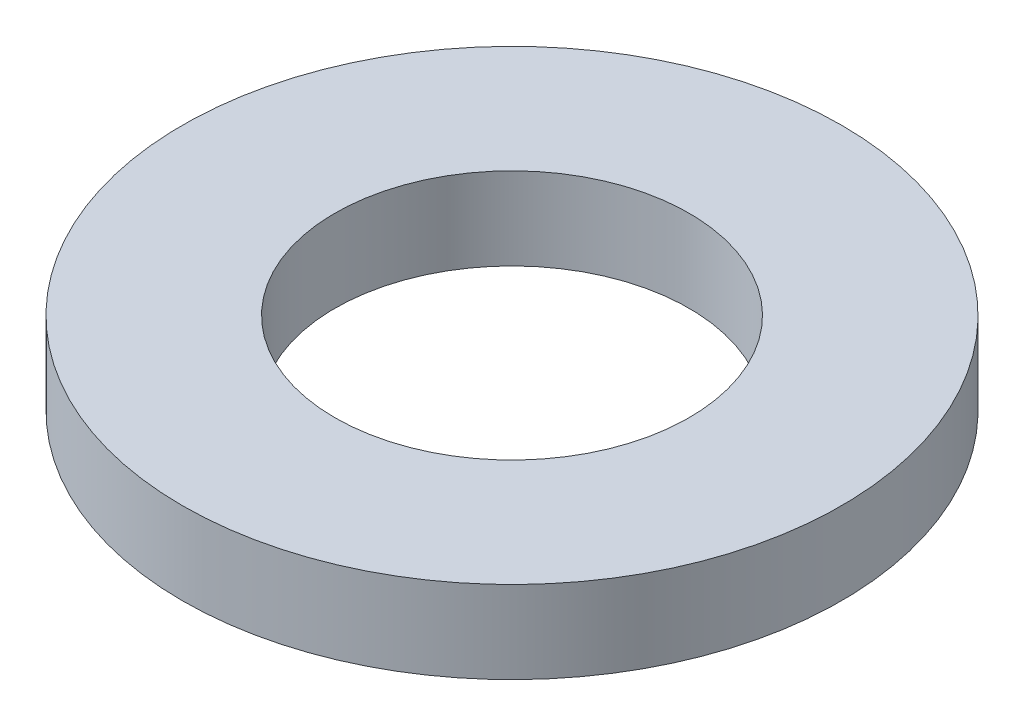
ISO-10303-21;
HEADER;
FILE_DESCRIPTION(('STEP AP214'),'2;1');
FILE_NAME('part.step','',(''),(''),'','','');
FILE_SCHEMA(('AUTOMOTIVE_DESIGN { 1 0 10303 214 1 1 1 1 }'));
ENDSEC;
DATA;
#1=APPLICATION_CONTEXT('core data for automotive mechanical design processes');
#2=APPLICATION_PROTOCOL_DEFINITION('international standard','automotive_design',2000,#1);
#3=PRODUCT_CONTEXT('',#1,'mechanical');
#4=PRODUCT('Part','Part','',(#3));
#5=PRODUCT_RELATED_PRODUCT_CATEGORY('part','',(#4));
#6=PRODUCT_DEFINITION_FORMATION('','',#4);
#7=PRODUCT_DEFINITION_CONTEXT('part definition',#1,'design');
#8=PRODUCT_DEFINITION('design','',#6,#7);
#9=PRODUCT_DEFINITION_SHAPE('','',#8);
#10=(LENGTH_UNIT() NAMED_UNIT(*) SI_UNIT(.MILLI.,.METRE.));
#11=(NAMED_UNIT(*) PLANE_ANGLE_UNIT() SI_UNIT($,.RADIAN.));
#12=(NAMED_UNIT(*) SI_UNIT($,.STERADIAN.) SOLID_ANGLE_UNIT());
#13=UNCERTAINTY_MEASURE_WITH_UNIT(LENGTH_MEASURE(1.E-05),#10,'distance_accuracy_value','');
#14=(GEOMETRIC_REPRESENTATION_CONTEXT(3) GLOBAL_UNCERTAINTY_ASSIGNED_CONTEXT((#13)) GLOBAL_UNIT_ASSIGNED_CONTEXT((#10,
#11,#12)) REPRESENTATION_CONTEXT('',''));
#15=CARTESIAN_POINT('',(0.,0.,0.));
#16=DIRECTION('',(0.,0.,1.));
#17=DIRECTION('',(1.,0.,0.));
#18=AXIS2_PLACEMENT_3D('',#15,#16,#17);
#19=CARTESIAN_POINT('',(0.,1.,0.));
#20=DIRECTION('',(0.,1.,0.));
#21=DIRECTION('',(0.,0.,1.));
#22=AXIS2_PLACEMENT_3D('',#19,#20,#21);
#23=PLANE('',#22);
#24=CARTESIAN_POINT('',(0.,1.,0.));
#25=DIRECTION('',(0.,1.,0.));
#26=DIRECTION('',(0.,0.,1.));
#27=AXIS2_PLACEMENT_3D('',#24,#25,#26);
#28=CIRCLE('',#27,4.);
#29=CARTESIAN_POINT('',(0.,1.,4.));
#30=VERTEX_POINT('',#29);
#31=EDGE_CURVE('E10',#30,#30,#28,.T.);
#32=ORIENTED_EDGE('',*,*,#31,.T.);
#33=EDGE_LOOP('',(#32));
#34=FACE_BOUND('',#33,.T.);
#35=CARTESIAN_POINT('',(0.,1.,0.));
#36=DIRECTION('',(0.,1.,0.));
#37=DIRECTION('',(0.,0.,1.));
#38=AXIS2_PLACEMENT_3D('',#35,#36,#37);
#39=CIRCLE('',#38,2.15);
#40=CARTESIAN_POINT('',(0.,1.,2.15));
#41=VERTEX_POINT('',#40);
#42=EDGE_CURVE('E48',#41,#41,#39,.T.);
#43=ORIENTED_EDGE('',*,*,#42,.F.);
#44=EDGE_LOOP('',(#43));
#45=FACE_BOUND('',#44,.T.);
#46=ADVANCED_FACE('F37',(#34,#45),#23,.T.);
#47=CARTESIAN_POINT('',(0.,0.,0.));
#48=DIRECTION('',(0.,1.,0.));
#49=DIRECTION('',(0.,0.,1.));
#50=AXIS2_PLACEMENT_3D('',#47,#48,#49);
#51=PLANE('',#50);
#52=CARTESIAN_POINT('',(0.,0.,0.));
#53=DIRECTION('',(0.,1.,0.));
#54=DIRECTION('',(0.,0.,1.));
#55=AXIS2_PLACEMENT_3D('',#52,#53,#54);
#56=CIRCLE('',#55,4.);
#57=CARTESIAN_POINT('',(0.,0.,4.));
#58=VERTEX_POINT('',#57);
#59=EDGE_CURVE('E41',#58,#58,#56,.T.);
#60=ORIENTED_EDGE('',*,*,#59,.F.);
#61=EDGE_LOOP('',(#60));
#62=FACE_BOUND('',#61,.T.);
#63=CARTESIAN_POINT('',(0.,0.,0.));
#64=DIRECTION('',(0.,1.,0.));
#65=DIRECTION('',(0.,0.,1.));
#66=AXIS2_PLACEMENT_3D('',#63,#64,#65);
#67=CIRCLE('',#66,2.15);
#68=CARTESIAN_POINT('',(0.,0.,2.15));
#69=VERTEX_POINT('',#68);
#70=EDGE_CURVE('E50',#69,#69,#67,.T.);
#71=ORIENTED_EDGE('',*,*,#70,.T.);
#72=EDGE_LOOP('',(#71));
#73=FACE_BOUND('',#72,.T.);
#74=ADVANCED_FACE('F60',(#62,#73),#51,.F.);
#75=CARTESIAN_POINT('',(0.,1.,0.));
#76=DIRECTION('',(0.,-1.,0.));
#77=DIRECTION('',(0.,0.,-1.));
#78=AXIS2_PLACEMENT_3D('',#75,#76,#77);
#79=CYLINDRICAL_SURFACE('',#78,4.);
#80=ORIENTED_EDGE('',*,*,#31,.F.);
#81=EDGE_LOOP('',(#80));
#82=FACE_BOUND('',#81,.T.);
#83=ORIENTED_EDGE('',*,*,#59,.T.);
#84=EDGE_LOOP('',(#83));
#85=FACE_BOUND('',#84,.T.);
#86=ADVANCED_FACE('F39',(#82,#85),#79,.T.);
#87=CARTESIAN_POINT('',(0.,1.,0.));
#88=DIRECTION('',(0.,-1.,0.));
#89=DIRECTION('',(0.,0.,-1.));
#90=AXIS2_PLACEMENT_3D('',#87,#88,#89);
#91=CYLINDRICAL_SURFACE('',#90,2.15);
#92=ORIENTED_EDGE('',*,*,#42,.T.);
#93=EDGE_LOOP('',(#92));
#94=FACE_BOUND('',#93,.T.);
#95=ORIENTED_EDGE('',*,*,#70,.F.);
#96=EDGE_LOOP('',(#95));
#97=FACE_BOUND('',#96,.T.);
#98=ADVANCED_FACE('F56',(#94,#97),#91,.F.);
#99=CLOSED_SHELL('',(#46,#74,#86,#98));
#100=MANIFOLD_SOLID_BREP('B2',#99);
#101=ADVANCED_BREP_SHAPE_REPRESENTATION('',(#18,#100),#14);
#102=SHAPE_DEFINITION_REPRESENTATION(#9,#101);
ENDSEC;
END-ISO-10303-21;
